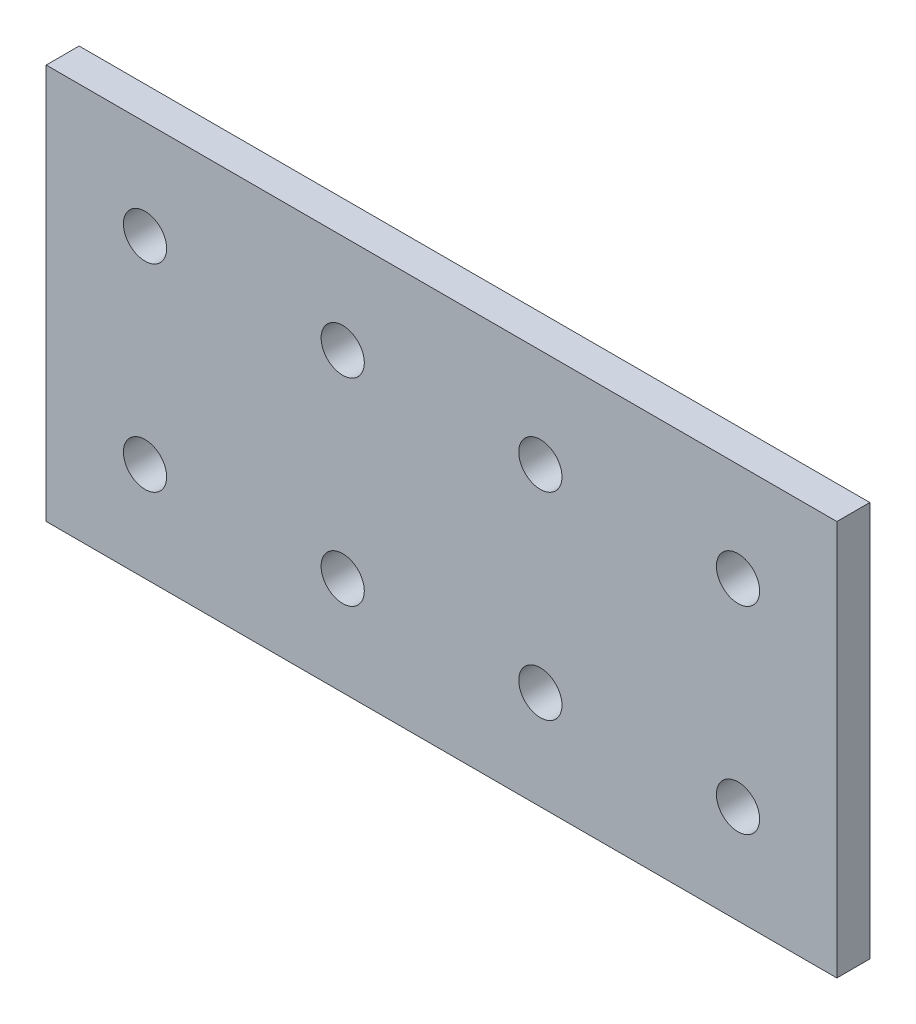
ISO-10303-21;
HEADER;
FILE_DESCRIPTION(('STEP AP214'),'2;1');
FILE_NAME('part.step','',(''),(''),'','','');
FILE_SCHEMA(('AUTOMOTIVE_DESIGN { 1 0 10303 214 1 1 1 1 }'));
ENDSEC;
DATA;
#1=APPLICATION_CONTEXT('core data for automotive mechanical design processes');
#2=APPLICATION_PROTOCOL_DEFINITION('international standard','automotive_design',2000,#1);
#3=PRODUCT_CONTEXT('',#1,'mechanical');
#4=PRODUCT('Part','Part','',(#3));
#5=PRODUCT_RELATED_PRODUCT_CATEGORY('part','',(#4));
#6=PRODUCT_DEFINITION_FORMATION('','',#4);
#7=PRODUCT_DEFINITION_CONTEXT('part definition',#1,'design');
#8=PRODUCT_DEFINITION('design','',#6,#7);
#9=PRODUCT_DEFINITION_SHAPE('','',#8);
#10=(LENGTH_UNIT() NAMED_UNIT(*) SI_UNIT(.MILLI.,.METRE.));
#11=(NAMED_UNIT(*) PLANE_ANGLE_UNIT() SI_UNIT($,.RADIAN.));
#12=(NAMED_UNIT(*) SI_UNIT($,.STERADIAN.) SOLID_ANGLE_UNIT());
#13=UNCERTAINTY_MEASURE_WITH_UNIT(LENGTH_MEASURE(1.E-05),#10,'distance_accuracy_value','');
#14=(GEOMETRIC_REPRESENTATION_CONTEXT(3) GLOBAL_UNCERTAINTY_ASSIGNED_CONTEXT((#13)) GLOBAL_UNIT_ASSIGNED_CONTEXT((#10,
#11,#12)) REPRESENTATION_CONTEXT('',''));
#15=CARTESIAN_POINT('',(0.,0.,0.));
#16=DIRECTION('',(0.,0.,1.));
#17=DIRECTION('',(1.,0.,0.));
#18=AXIS2_PLACEMENT_3D('',#15,#16,#17);
#19=CARTESIAN_POINT('',(0.,0.,3.175));
#20=DIRECTION('',(0.,0.,-1.));
#21=DIRECTION('',(-1.,0.,0.));
#22=AXIS2_PLACEMENT_3D('',#19,#20,#21);
#23=PLANE('',#22);
#24=CARTESIAN_POINT('',(95.25,57.15,3.175));
#25=DIRECTION('',(0.,0.,1.));
#26=DIRECTION('',(1.,0.,0.));
#27=AXIS2_PLACEMENT_3D('',#24,#25,#26);
#28=CIRCLE('',#27,4.1656);
#29=CARTESIAN_POINT('',(99.4156,57.15,3.175));
#30=VERTEX_POINT('',#29);
#31=EDGE_CURVE('E144',#30,#30,#28,.T.);
#32=ORIENTED_EDGE('',*,*,#31,.F.);
#33=EDGE_LOOP('',(#32));
#34=FACE_BOUND('',#33,.T.);
#35=CARTESIAN_POINT('',(19.05,57.15,3.175));
#36=DIRECTION('',(0.,0.,1.));
#37=DIRECTION('',(1.,0.,0.));
#38=AXIS2_PLACEMENT_3D('',#35,#36,#37);
#39=CIRCLE('',#38,4.1656);
#40=CARTESIAN_POINT('',(23.2156,57.15,3.175));
#41=VERTEX_POINT('',#40);
#42=EDGE_CURVE('E132',#41,#41,#39,.T.);
#43=ORIENTED_EDGE('',*,*,#42,.F.);
#44=EDGE_LOOP('',(#43));
#45=FACE_BOUND('',#44,.T.);
#46=CARTESIAN_POINT('',(95.25,19.05,3.175));
#47=DIRECTION('',(0.,0.,1.));
#48=DIRECTION('',(1.,0.,0.));
#49=AXIS2_PLACEMENT_3D('',#46,#47,#48);
#50=CIRCLE('',#49,4.1656);
#51=CARTESIAN_POINT('',(99.4156,19.05,3.175));
#52=VERTEX_POINT('',#51);
#53=EDGE_CURVE('E120',#52,#52,#50,.T.);
#54=ORIENTED_EDGE('',*,*,#53,.F.);
#55=EDGE_LOOP('',(#54));
#56=FACE_BOUND('',#55,.T.);
#57=CARTESIAN_POINT('',(19.05,19.05,3.175));
#58=DIRECTION('',(0.,0.,1.));
#59=DIRECTION('',(1.,0.,0.));
#60=AXIS2_PLACEMENT_3D('',#57,#58,#59);
#61=CIRCLE('',#60,4.1656);
#62=CARTESIAN_POINT('',(23.2156,19.05,3.175));
#63=VERTEX_POINT('',#62);
#64=EDGE_CURVE('E99',#63,#63,#61,.T.);
#65=ORIENTED_EDGE('',*,*,#64,.F.);
#66=EDGE_LOOP('',(#65));
#67=FACE_BOUND('',#66,.T.);
#68=DIRECTION('',(1.,0.,0.));
#69=VECTOR('',#68,1.);
#70=CARTESIAN_POINT('',(152.4,0.,3.175));
#71=LINE('',#70,#69);
#72=CARTESIAN_POINT('',(0.,0.,3.175));
#73=VERTEX_POINT('',#72);
#74=CARTESIAN_POINT('',(152.4,0.,3.175));
#75=VERTEX_POINT('',#74);
#76=EDGE_CURVE('E84',#73,#75,#71,.T.);
#77=ORIENTED_EDGE('',*,*,#76,.T.);
#78=DIRECTION('',(0.,1.,0.));
#79=VECTOR('',#78,1.);
#80=CARTESIAN_POINT('',(152.4,76.2,3.175));
#81=LINE('',#80,#79);
#82=CARTESIAN_POINT('',(152.4,76.2,3.175));
#83=VERTEX_POINT('',#82);
#84=EDGE_CURVE('E79',#75,#83,#81,.T.);
#85=ORIENTED_EDGE('',*,*,#84,.T.);
#86=DIRECTION('',(-1.,0.,0.));
#87=VECTOR('',#86,1.);
#88=CARTESIAN_POINT('',(152.4,76.2,3.175));
#89=LINE('',#88,#87);
#90=CARTESIAN_POINT('',(0.,76.2,3.175));
#91=VERTEX_POINT('',#90);
#92=EDGE_CURVE('E82',#83,#91,#89,.T.);
#93=ORIENTED_EDGE('',*,*,#92,.T.);
#94=DIRECTION('',(0.,-1.,0.));
#95=VECTOR('',#94,1.);
#96=CARTESIAN_POINT('',(0.,0.,3.175));
#97=LINE('',#96,#95);
#98=EDGE_CURVE('E49',#91,#73,#97,.T.);
#99=ORIENTED_EDGE('',*,*,#98,.T.);
#100=EDGE_LOOP('',(#77,#85,#93,#99));
#101=FACE_BOUND('',#100,.T.);
#102=CARTESIAN_POINT('',(57.15,19.05,3.175));
#103=DIRECTION('',(0.,0.,1.));
#104=DIRECTION('',(1.,0.,0.));
#105=AXIS2_PLACEMENT_3D('',#102,#103,#104);
#106=CIRCLE('',#105,4.1656);
#107=CARTESIAN_POINT('',(61.3156,19.05,3.175));
#108=VERTEX_POINT('',#107);
#109=EDGE_CURVE('E114',#108,#108,#106,.T.);
#110=ORIENTED_EDGE('',*,*,#109,.F.);
#111=EDGE_LOOP('',(#110));
#112=FACE_BOUND('',#111,.T.);
#113=CARTESIAN_POINT('',(133.35,19.05,3.175));
#114=DIRECTION('',(0.,0.,1.));
#115=DIRECTION('',(1.,0.,0.));
#116=AXIS2_PLACEMENT_3D('',#113,#114,#115);
#117=CIRCLE('',#116,4.1656);
#118=CARTESIAN_POINT('',(137.5156,19.05,3.175));
#119=VERTEX_POINT('',#118);
#120=EDGE_CURVE('E126',#119,#119,#117,.T.);
#121=ORIENTED_EDGE('',*,*,#120,.F.);
#122=EDGE_LOOP('',(#121));
#123=FACE_BOUND('',#122,.T.);
#124=CARTESIAN_POINT('',(57.15,57.15,3.175));
#125=DIRECTION('',(0.,0.,1.));
#126=DIRECTION('',(1.,0.,0.));
#127=AXIS2_PLACEMENT_3D('',#124,#125,#126);
#128=CIRCLE('',#127,4.1656);
#129=CARTESIAN_POINT('',(61.3156,57.15,3.175));
#130=VERTEX_POINT('',#129);
#131=EDGE_CURVE('E138',#130,#130,#128,.T.);
#132=ORIENTED_EDGE('',*,*,#131,.F.);
#133=EDGE_LOOP('',(#132));
#134=FACE_BOUND('',#133,.T.);
#135=CARTESIAN_POINT('',(133.35,57.15,3.175));
#136=DIRECTION('',(0.,0.,1.));
#137=DIRECTION('',(1.,0.,0.));
#138=AXIS2_PLACEMENT_3D('',#135,#136,#137);
#139=CIRCLE('',#138,4.1656);
#140=CARTESIAN_POINT('',(137.5156,57.15,3.175));
#141=VERTEX_POINT('',#140);
#142=EDGE_CURVE('E150',#141,#141,#139,.T.);
#143=ORIENTED_EDGE('',*,*,#142,.F.);
#144=EDGE_LOOP('',(#143));
#145=FACE_BOUND('',#144,.T.);
#146=ADVANCED_FACE('F32',(#34,#45,#56,#67,#101,#112,#123,#134,#145),#23,.F.);
#147=CARTESIAN_POINT('',(0.,0.,-3.175));
#148=DIRECTION('',(0.,0.,-1.));
#149=DIRECTION('',(-1.,0.,0.));
#150=AXIS2_PLACEMENT_3D('',#147,#148,#149);
#151=PLANE('',#150);
#152=CARTESIAN_POINT('',(95.25,57.15,-3.175));
#153=DIRECTION('',(0.,0.,1.));
#154=DIRECTION('',(1.,0.,0.));
#155=AXIS2_PLACEMENT_3D('',#152,#153,#154);
#156=CIRCLE('',#155,4.1656);
#157=CARTESIAN_POINT('',(99.4156,57.15,-3.175));
#158=VERTEX_POINT('',#157);
#159=EDGE_CURVE('E147',#158,#158,#156,.T.);
#160=ORIENTED_EDGE('',*,*,#159,.T.);
#161=EDGE_LOOP('',(#160));
#162=FACE_BOUND('',#161,.T.);
#163=CARTESIAN_POINT('',(19.05,57.15,-3.175));
#164=DIRECTION('',(0.,0.,1.));
#165=DIRECTION('',(1.,0.,0.));
#166=AXIS2_PLACEMENT_3D('',#163,#164,#165);
#167=CIRCLE('',#166,4.1656);
#168=CARTESIAN_POINT('',(23.2156,57.15,-3.175));
#169=VERTEX_POINT('',#168);
#170=EDGE_CURVE('E135',#169,#169,#167,.T.);
#171=ORIENTED_EDGE('',*,*,#170,.T.);
#172=EDGE_LOOP('',(#171));
#173=FACE_BOUND('',#172,.T.);
#174=CARTESIAN_POINT('',(95.25,19.05,-3.175));
#175=DIRECTION('',(0.,0.,1.));
#176=DIRECTION('',(1.,0.,0.));
#177=AXIS2_PLACEMENT_3D('',#174,#175,#176);
#178=CIRCLE('',#177,4.1656);
#179=CARTESIAN_POINT('',(99.4156,19.05,-3.175));
#180=VERTEX_POINT('',#179);
#181=EDGE_CURVE('E123',#180,#180,#178,.T.);
#182=ORIENTED_EDGE('',*,*,#181,.T.);
#183=EDGE_LOOP('',(#182));
#184=FACE_BOUND('',#183,.T.);
#185=CARTESIAN_POINT('',(19.05,19.05,-3.175));
#186=DIRECTION('',(0.,0.,1.));
#187=DIRECTION('',(1.,0.,0.));
#188=AXIS2_PLACEMENT_3D('',#185,#186,#187);
#189=CIRCLE('',#188,4.1656);
#190=CARTESIAN_POINT('',(23.2156,19.05,-3.175));
#191=VERTEX_POINT('',#190);
#192=EDGE_CURVE('E111',#191,#191,#189,.T.);
#193=ORIENTED_EDGE('',*,*,#192,.T.);
#194=EDGE_LOOP('',(#193));
#195=FACE_BOUND('',#194,.T.);
#196=DIRECTION('',(1.,0.,0.));
#197=VECTOR('',#196,1.);
#198=CARTESIAN_POINT('',(152.4,0.,-3.175));
#199=LINE('',#198,#197);
#200=CARTESIAN_POINT('',(0.,0.,-3.175));
#201=VERTEX_POINT('',#200);
#202=CARTESIAN_POINT('',(152.4,0.,-3.175));
#203=VERTEX_POINT('',#202);
#204=EDGE_CURVE('E96',#201,#203,#199,.T.);
#205=ORIENTED_EDGE('',*,*,#204,.F.);
#206=DIRECTION('',(0.,-1.,0.));
#207=VECTOR('',#206,1.);
#208=CARTESIAN_POINT('',(0.,0.,-3.175));
#209=LINE('',#208,#207);
#210=CARTESIAN_POINT('',(0.,76.2,-3.175));
#211=VERTEX_POINT('',#210);
#212=EDGE_CURVE('E72',#211,#201,#209,.T.);
#213=ORIENTED_EDGE('',*,*,#212,.F.);
#214=DIRECTION('',(-1.,0.,0.));
#215=VECTOR('',#214,1.);
#216=CARTESIAN_POINT('',(152.4,76.2,-3.175));
#217=LINE('',#216,#215);
#218=CARTESIAN_POINT('',(152.4,76.2,-3.175));
#219=VERTEX_POINT('',#218);
#220=EDGE_CURVE('E66',#219,#211,#217,.T.);
#221=ORIENTED_EDGE('',*,*,#220,.F.);
#222=DIRECTION('',(0.,1.,0.));
#223=VECTOR('',#222,1.);
#224=CARTESIAN_POINT('',(152.4,76.2,-3.175));
#225=LINE('',#224,#223);
#226=EDGE_CURVE('E88',#203,#219,#225,.T.);
#227=ORIENTED_EDGE('',*,*,#226,.F.);
#228=EDGE_LOOP('',(#205,#213,#221,#227));
#229=FACE_BOUND('',#228,.T.);
#230=CARTESIAN_POINT('',(57.15,19.05,-3.175));
#231=DIRECTION('',(0.,0.,1.));
#232=DIRECTION('',(1.,0.,0.));
#233=AXIS2_PLACEMENT_3D('',#230,#231,#232);
#234=CIRCLE('',#233,4.1656);
#235=CARTESIAN_POINT('',(61.3156,19.05,-3.175));
#236=VERTEX_POINT('',#235);
#237=EDGE_CURVE('E117',#236,#236,#234,.T.);
#238=ORIENTED_EDGE('',*,*,#237,.T.);
#239=EDGE_LOOP('',(#238));
#240=FACE_BOUND('',#239,.T.);
#241=CARTESIAN_POINT('',(133.35,19.05,-3.175));
#242=DIRECTION('',(0.,0.,1.));
#243=DIRECTION('',(1.,0.,0.));
#244=AXIS2_PLACEMENT_3D('',#241,#242,#243);
#245=CIRCLE('',#244,4.1656);
#246=CARTESIAN_POINT('',(137.5156,19.05,-3.175));
#247=VERTEX_POINT('',#246);
#248=EDGE_CURVE('E129',#247,#247,#245,.T.);
#249=ORIENTED_EDGE('',*,*,#248,.T.);
#250=EDGE_LOOP('',(#249));
#251=FACE_BOUND('',#250,.T.);
#252=CARTESIAN_POINT('',(57.15,57.15,-3.175));
#253=DIRECTION('',(0.,0.,1.));
#254=DIRECTION('',(1.,0.,0.));
#255=AXIS2_PLACEMENT_3D('',#252,#253,#254);
#256=CIRCLE('',#255,4.1656);
#257=CARTESIAN_POINT('',(61.3156,57.15,-3.175));
#258=VERTEX_POINT('',#257);
#259=EDGE_CURVE('E141',#258,#258,#256,.T.);
#260=ORIENTED_EDGE('',*,*,#259,.T.);
#261=EDGE_LOOP('',(#260));
#262=FACE_BOUND('',#261,.T.);
#263=CARTESIAN_POINT('',(133.35,57.15,-3.175));
#264=DIRECTION('',(0.,0.,1.));
#265=DIRECTION('',(1.,0.,0.));
#266=AXIS2_PLACEMENT_3D('',#263,#264,#265);
#267=CIRCLE('',#266,4.1656);
#268=CARTESIAN_POINT('',(137.5156,57.15,-3.175));
#269=VERTEX_POINT('',#268);
#270=EDGE_CURVE('E153',#269,#269,#267,.T.);
#271=ORIENTED_EDGE('',*,*,#270,.T.);
#272=EDGE_LOOP('',(#271));
#273=FACE_BOUND('',#272,.T.);
#274=ADVANCED_FACE('F107',(#162,#173,#184,#195,#229,#240,#251,#262,#273),#151,.T.);
#275=CARTESIAN_POINT('',(152.4,0.,3.175));
#276=DIRECTION('',(0.,1.,0.));
#277=DIRECTION('',(-1.,0.,0.));
#278=AXIS2_PLACEMENT_3D('',#275,#276,#277);
#279=PLANE('',#278);
#280=ORIENTED_EDGE('',*,*,#204,.T.);
#281=DIRECTION('',(0.,0.,-1.));
#282=VECTOR('',#281,1.);
#283=CARTESIAN_POINT('',(152.4,0.,3.175));
#284=LINE('',#283,#282);
#285=EDGE_CURVE('E11',#75,#203,#284,.T.);
#286=ORIENTED_EDGE('',*,*,#285,.F.);
#287=ORIENTED_EDGE('',*,*,#76,.F.);
#288=DIRECTION('',(0.,0.,-1.));
#289=VECTOR('',#288,1.);
#290=CARTESIAN_POINT('',(0.,0.,3.175));
#291=LINE('',#290,#289);
#292=EDGE_CURVE('E92',#73,#201,#291,.T.);
#293=ORIENTED_EDGE('',*,*,#292,.T.);
#294=EDGE_LOOP('',(#280,#286,#287,#293));
#295=FACE_BOUND('',#294,.T.);
#296=ADVANCED_FACE('F34',(#295),#279,.F.);
#297=CARTESIAN_POINT('',(152.4,76.2,3.175));
#298=DIRECTION('',(-1.,0.,0.));
#299=DIRECTION('',(0.,0.,1.));
#300=AXIS2_PLACEMENT_3D('',#297,#298,#299);
#301=PLANE('',#300);
#302=ORIENTED_EDGE('',*,*,#226,.T.);
#303=DIRECTION('',(0.,0.,-1.));
#304=VECTOR('',#303,1.);
#305=CARTESIAN_POINT('',(152.4,76.2,3.175));
#306=LINE('',#305,#304);
#307=EDGE_CURVE('E41',#83,#219,#306,.T.);
#308=ORIENTED_EDGE('',*,*,#307,.F.);
#309=ORIENTED_EDGE('',*,*,#84,.F.);
#310=ORIENTED_EDGE('',*,*,#285,.T.);
#311=EDGE_LOOP('',(#302,#308,#309,#310));
#312=FACE_BOUND('',#311,.T.);
#313=ADVANCED_FACE('F87',(#312),#301,.F.);
#314=CARTESIAN_POINT('',(152.4,76.2,3.175));
#315=DIRECTION('',(0.,-1.,0.));
#316=DIRECTION('',(1.,0.,0.));
#317=AXIS2_PLACEMENT_3D('',#314,#315,#316);
#318=PLANE('',#317);
#319=ORIENTED_EDGE('',*,*,#220,.T.);
#320=DIRECTION('',(0.,0.,-1.));
#321=VECTOR('',#320,1.);
#322=CARTESIAN_POINT('',(0.,76.2,3.175));
#323=LINE('',#322,#321);
#324=EDGE_CURVE('E89',#91,#211,#323,.T.);
#325=ORIENTED_EDGE('',*,*,#324,.F.);
#326=ORIENTED_EDGE('',*,*,#92,.F.);
#327=ORIENTED_EDGE('',*,*,#307,.T.);
#328=EDGE_LOOP('',(#319,#325,#326,#327));
#329=FACE_BOUND('',#328,.T.);
#330=ADVANCED_FACE('F90',(#329),#318,.F.);
#331=CARTESIAN_POINT('',(0.,0.,3.175));
#332=DIRECTION('',(1.,0.,0.));
#333=DIRECTION('',(0.,0.,-1.));
#334=AXIS2_PLACEMENT_3D('',#331,#332,#333);
#335=PLANE('',#334);
#336=ORIENTED_EDGE('',*,*,#212,.T.);
#337=ORIENTED_EDGE('',*,*,#292,.F.);
#338=ORIENTED_EDGE('',*,*,#98,.F.);
#339=ORIENTED_EDGE('',*,*,#324,.T.);
#340=EDGE_LOOP('',(#336,#337,#338,#339));
#341=FACE_BOUND('',#340,.T.);
#342=ADVANCED_FACE('F104',(#341),#335,.F.);
#343=CARTESIAN_POINT('',(19.05,19.05,3.175));
#344=DIRECTION('',(0.,0.,-1.));
#345=DIRECTION('',(-1.,0.,0.));
#346=AXIS2_PLACEMENT_3D('',#343,#344,#345);
#347=CYLINDRICAL_SURFACE('',#346,4.1656);
#348=ORIENTED_EDGE('',*,*,#64,.T.);
#349=EDGE_LOOP('',(#348));
#350=FACE_BOUND('',#349,.T.);
#351=ORIENTED_EDGE('',*,*,#192,.F.);
#352=EDGE_LOOP('',(#351));
#353=FACE_BOUND('',#352,.T.);
#354=ADVANCED_FACE('F173',(#350,#353),#347,.F.);
#355=CARTESIAN_POINT('',(57.15,19.05,3.175));
#356=DIRECTION('',(0.,0.,-1.));
#357=DIRECTION('',(-1.,0.,0.));
#358=AXIS2_PLACEMENT_3D('',#355,#356,#357);
#359=CYLINDRICAL_SURFACE('',#358,4.1656);
#360=ORIENTED_EDGE('',*,*,#109,.T.);
#361=EDGE_LOOP('',(#360));
#362=FACE_BOUND('',#361,.T.);
#363=ORIENTED_EDGE('',*,*,#237,.F.);
#364=EDGE_LOOP('',(#363));
#365=FACE_BOUND('',#364,.T.);
#366=ADVANCED_FACE('F219',(#362,#365),#359,.F.);
#367=CARTESIAN_POINT('',(95.25,19.05,3.175));
#368=DIRECTION('',(0.,0.,-1.));
#369=DIRECTION('',(-1.,0.,0.));
#370=AXIS2_PLACEMENT_3D('',#367,#368,#369);
#371=CYLINDRICAL_SURFACE('',#370,4.1656);
#372=ORIENTED_EDGE('',*,*,#53,.T.);
#373=EDGE_LOOP('',(#372));
#374=FACE_BOUND('',#373,.T.);
#375=ORIENTED_EDGE('',*,*,#181,.F.);
#376=EDGE_LOOP('',(#375));
#377=FACE_BOUND('',#376,.T.);
#378=ADVANCED_FACE('F227',(#374,#377),#371,.F.);
#379=CARTESIAN_POINT('',(133.35,19.05,3.175));
#380=DIRECTION('',(0.,0.,-1.));
#381=DIRECTION('',(-1.,0.,0.));
#382=AXIS2_PLACEMENT_3D('',#379,#380,#381);
#383=CYLINDRICAL_SURFACE('',#382,4.1656);
#384=ORIENTED_EDGE('',*,*,#120,.T.);
#385=EDGE_LOOP('',(#384));
#386=FACE_BOUND('',#385,.T.);
#387=ORIENTED_EDGE('',*,*,#248,.F.);
#388=EDGE_LOOP('',(#387));
#389=FACE_BOUND('',#388,.T.);
#390=ADVANCED_FACE('F235',(#386,#389),#383,.F.);
#391=CARTESIAN_POINT('',(19.05,57.15,3.175));
#392=DIRECTION('',(0.,0.,-1.));
#393=DIRECTION('',(-1.,0.,0.));
#394=AXIS2_PLACEMENT_3D('',#391,#392,#393);
#395=CYLINDRICAL_SURFACE('',#394,4.1656);
#396=ORIENTED_EDGE('',*,*,#42,.T.);
#397=EDGE_LOOP('',(#396));
#398=FACE_BOUND('',#397,.T.);
#399=ORIENTED_EDGE('',*,*,#170,.F.);
#400=EDGE_LOOP('',(#399));
#401=FACE_BOUND('',#400,.T.);
#402=ADVANCED_FACE('F244',(#398,#401),#395,.F.);
#403=CARTESIAN_POINT('',(57.15,57.15,3.175));
#404=DIRECTION('',(0.,0.,-1.));
#405=DIRECTION('',(-1.,0.,0.));
#406=AXIS2_PLACEMENT_3D('',#403,#404,#405);
#407=CYLINDRICAL_SURFACE('',#406,4.1656);
#408=ORIENTED_EDGE('',*,*,#131,.T.);
#409=EDGE_LOOP('',(#408));
#410=FACE_BOUND('',#409,.T.);
#411=ORIENTED_EDGE('',*,*,#259,.F.);
#412=EDGE_LOOP('',(#411));
#413=FACE_BOUND('',#412,.T.);
#414=ADVANCED_FACE('F253',(#410,#413),#407,.F.);
#415=CARTESIAN_POINT('',(95.25,57.15,3.175));
#416=DIRECTION('',(0.,0.,-1.));
#417=DIRECTION('',(-1.,0.,0.));
#418=AXIS2_PLACEMENT_3D('',#415,#416,#417);
#419=CYLINDRICAL_SURFACE('',#418,4.1656);
#420=ORIENTED_EDGE('',*,*,#31,.T.);
#421=EDGE_LOOP('',(#420));
#422=FACE_BOUND('',#421,.T.);
#423=ORIENTED_EDGE('',*,*,#159,.F.);
#424=EDGE_LOOP('',(#423));
#425=FACE_BOUND('',#424,.T.);
#426=ADVANCED_FACE('F262',(#422,#425),#419,.F.);
#427=CARTESIAN_POINT('',(133.35,57.15,3.175));
#428=DIRECTION('',(0.,0.,-1.));
#429=DIRECTION('',(-1.,0.,0.));
#430=AXIS2_PLACEMENT_3D('',#427,#428,#429);
#431=CYLINDRICAL_SURFACE('',#430,4.1656);
#432=ORIENTED_EDGE('',*,*,#142,.T.);
#433=EDGE_LOOP('',(#432));
#434=FACE_BOUND('',#433,.T.);
#435=ORIENTED_EDGE('',*,*,#270,.F.);
#436=EDGE_LOOP('',(#435));
#437=FACE_BOUND('',#436,.T.);
#438=ADVANCED_FACE('F159',(#434,#437),#431,.F.);
#439=CLOSED_SHELL('',(#146,#274,#296,#313,#330,#342,#354,#366,#378,#390,#402,#414,#426,#438));
#440=MANIFOLD_SOLID_BREP('B2',#439);
#441=ADVANCED_BREP_SHAPE_REPRESENTATION('',(#18,#440),#14);
#442=SHAPE_DEFINITION_REPRESENTATION(#9,#441);
ENDSEC;
END-ISO-10303-21;
